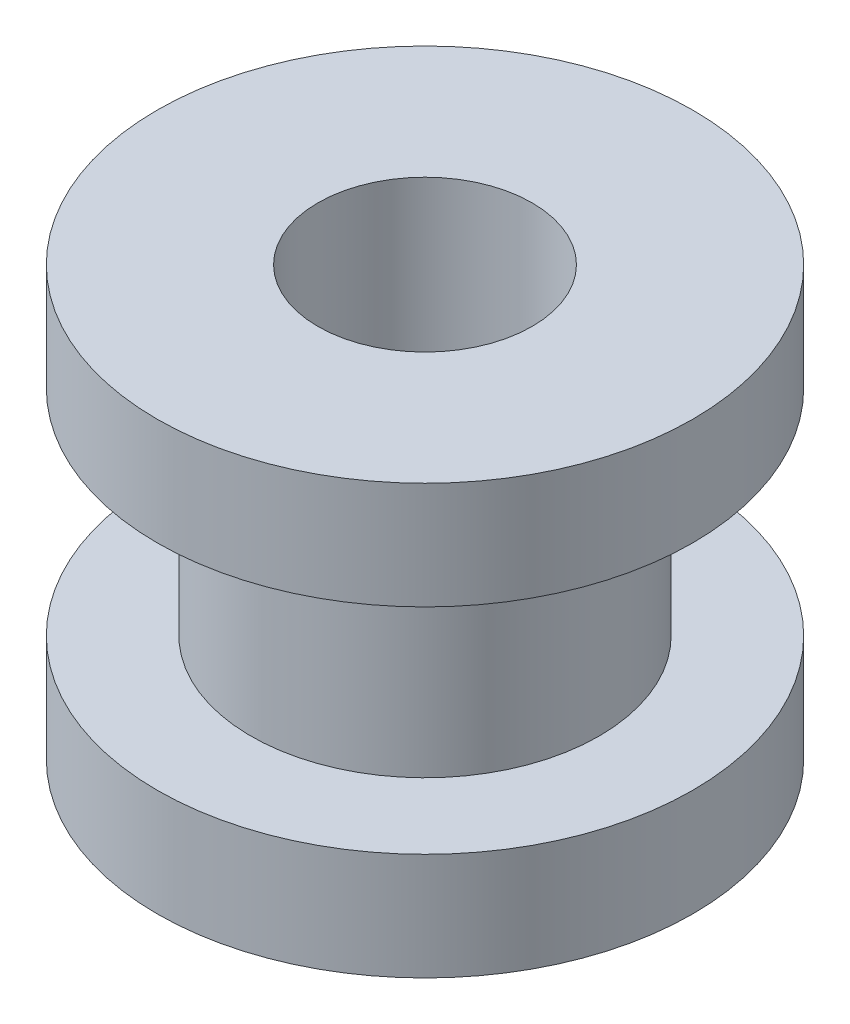
ISO-10303-21;
HEADER;
FILE_DESCRIPTION(('STEP AP214'),'2;1');
FILE_NAME('part.step','',(''),(''),'','','');
FILE_SCHEMA(('AUTOMOTIVE_DESIGN { 1 0 10303 214 1 1 1 1 }'));
ENDSEC;
DATA;
#1=APPLICATION_CONTEXT('core data for automotive mechanical design processes');
#2=APPLICATION_PROTOCOL_DEFINITION('international standard','automotive_design',2000,#1);
#3=PRODUCT_CONTEXT('',#1,'mechanical');
#4=PRODUCT('Part','Part','',(#3));
#5=PRODUCT_RELATED_PRODUCT_CATEGORY('part','',(#4));
#6=PRODUCT_DEFINITION_FORMATION('','',#4);
#7=PRODUCT_DEFINITION_CONTEXT('part definition',#1,'design');
#8=PRODUCT_DEFINITION('design','',#6,#7);
#9=PRODUCT_DEFINITION_SHAPE('','',#8);
#10=(LENGTH_UNIT() NAMED_UNIT(*) SI_UNIT(.MILLI.,.METRE.));
#11=(NAMED_UNIT(*) PLANE_ANGLE_UNIT() SI_UNIT($,.RADIAN.));
#12=(NAMED_UNIT(*) SI_UNIT($,.STERADIAN.) SOLID_ANGLE_UNIT());
#13=UNCERTAINTY_MEASURE_WITH_UNIT(LENGTH_MEASURE(1.E-05),#10,'distance_accuracy_value','');
#14=(GEOMETRIC_REPRESENTATION_CONTEXT(3) GLOBAL_UNCERTAINTY_ASSIGNED_CONTEXT((#13)) GLOBAL_UNIT_ASSIGNED_CONTEXT((#10,
#11,#12)) REPRESENTATION_CONTEXT('',''));
#15=CARTESIAN_POINT('',(0.,0.,0.));
#16=DIRECTION('',(0.,0.,1.));
#17=DIRECTION('',(1.,0.,0.));
#18=AXIS2_PLACEMENT_3D('',#15,#16,#17);
#19=CARTESIAN_POINT('',(5.,4.00000000000001,0.));
#20=DIRECTION('',(0.,1.,0.));
#21=DIRECTION('',(-1.,0.,0.));
#22=AXIS2_PLACEMENT_3D('',#19,#20,#21);
#23=PLANE('',#22);
#24=CARTESIAN_POINT('',(0.,4.,0.));
#25=DIRECTION('',(0.,-1.,0.));
#26=DIRECTION('',(1.,0.,0.));
#27=AXIS2_PLACEMENT_3D('',#24,#25,#26);
#28=CIRCLE('',#27,2.00000000000001);
#29=CARTESIAN_POINT('',(2.,4.00000000000001,0.));
#30=VERTEX_POINT('',#29);
#31=EDGE_CURVE('E10',#30,#30,#28,.T.);
#32=ORIENTED_EDGE('',*,*,#31,.T.);
#33=EDGE_LOOP('',(#32));
#34=FACE_BOUND('',#33,.T.);
#35=CARTESIAN_POINT('',(0.,3.99999999999998,0.));
#36=DIRECTION('',(0.,-1.,0.));
#37=DIRECTION('',(1.,0.,0.));
#38=AXIS2_PLACEMENT_3D('',#35,#36,#37);
#39=CIRCLE('',#38,5.00000000000001);
#40=CARTESIAN_POINT('',(5.,3.99999999999999,0.));
#41=VERTEX_POINT('',#40);
#42=EDGE_CURVE('E64',#41,#41,#39,.T.);
#43=ORIENTED_EDGE('',*,*,#42,.F.);
#44=EDGE_LOOP('',(#43));
#45=FACE_BOUND('',#44,.T.);
#46=ADVANCED_FACE('F36',(#34,#45),#23,.T.);
#47=CARTESIAN_POINT('',(7.25416571160379E-13,-211.476359703337,0.));
#48=DIRECTION('',(0.,-1.,0.));
#49=DIRECTION('',(1.,0.,0.));
#50=AXIS2_PLACEMENT_3D('',#47,#48,#49);
#51=CYLINDRICAL_SURFACE('',#50,2.);
#52=CARTESIAN_POINT('',(0.,-4.,0.));
#53=DIRECTION('',(0.,-1.,0.));
#54=DIRECTION('',(1.,0.,0.));
#55=AXIS2_PLACEMENT_3D('',#52,#53,#54);
#56=CIRCLE('',#55,1.99999999999999);
#57=CARTESIAN_POINT('',(2.,-4.,0.));
#58=VERTEX_POINT('',#57);
#59=EDGE_CURVE('E42',#58,#58,#56,.T.);
#60=ORIENTED_EDGE('',*,*,#59,.T.);
#61=EDGE_LOOP('',(#60));
#62=FACE_BOUND('',#61,.T.);
#63=ORIENTED_EDGE('',*,*,#31,.F.);
#64=EDGE_LOOP('',(#63));
#65=FACE_BOUND('',#64,.T.);
#66=ADVANCED_FACE('F72',(#62,#65),#51,.F.);
#67=CARTESIAN_POINT('',(2.,-4.00000000000001,0.));
#68=DIRECTION('',(0.,-1.,0.));
#69=DIRECTION('',(1.,0.,0.));
#70=AXIS2_PLACEMENT_3D('',#67,#68,#69);
#71=PLANE('',#70);
#72=CARTESIAN_POINT('',(0.,-4.00000000000003,0.));
#73=DIRECTION('',(0.,-1.,0.));
#74=DIRECTION('',(1.,0.,0.));
#75=AXIS2_PLACEMENT_3D('',#72,#73,#74);
#76=CIRCLE('',#75,4.99999999999999);
#77=CARTESIAN_POINT('',(5.,-4.00000000000001,0.));
#78=VERTEX_POINT('',#77);
#79=EDGE_CURVE('E46',#78,#78,#76,.T.);
#80=ORIENTED_EDGE('',*,*,#79,.T.);
#81=EDGE_LOOP('',(#80));
#82=FACE_BOUND('',#81,.T.);
#83=ORIENTED_EDGE('',*,*,#59,.F.);
#84=EDGE_LOOP('',(#83));
#85=FACE_BOUND('',#84,.T.);
#86=ADVANCED_FACE('F76',(#82,#85),#71,.T.);
#87=CARTESIAN_POINT('',(7.25416571160379E-13,-211.476359703337,0.));
#88=DIRECTION('',(0.,-1.,0.));
#89=DIRECTION('',(1.,0.,0.));
#90=AXIS2_PLACEMENT_3D('',#87,#88,#89);
#91=CYLINDRICAL_SURFACE('',#90,4.99999999999999);
#92=CARTESIAN_POINT('',(0.,-2.00000000000003,0.));
#93=DIRECTION('',(0.,-1.,0.));
#94=DIRECTION('',(1.,0.,0.));
#95=AXIS2_PLACEMENT_3D('',#92,#93,#94);
#96=CIRCLE('',#95,4.99999999999999);
#97=CARTESIAN_POINT('',(5.,-2.00000000000001,0.));
#98=VERTEX_POINT('',#97);
#99=EDGE_CURVE('E50',#98,#98,#96,.T.);
#100=ORIENTED_EDGE('',*,*,#99,.T.);
#101=EDGE_LOOP('',(#100));
#102=FACE_BOUND('',#101,.T.);
#103=ORIENTED_EDGE('',*,*,#79,.F.);
#104=EDGE_LOOP('',(#103));
#105=FACE_BOUND('',#104,.T.);
#106=ADVANCED_FACE('F80',(#102,#105),#91,.T.);
#107=CARTESIAN_POINT('',(5.,-2.,0.));
#108=DIRECTION('',(0.,1.,0.));
#109=DIRECTION('',(-1.,0.,0.));
#110=AXIS2_PLACEMENT_3D('',#107,#108,#109);
#111=PLANE('',#110);
#112=CARTESIAN_POINT('',(0.,-2.,0.));
#113=DIRECTION('',(0.,-1.,0.));
#114=DIRECTION('',(1.,0.,0.));
#115=AXIS2_PLACEMENT_3D('',#112,#113,#114);
#116=CIRCLE('',#115,3.24999999999999);
#117=CARTESIAN_POINT('',(3.25,-1.99999999999999,0.));
#118=VERTEX_POINT('',#117);
#119=EDGE_CURVE('E55',#118,#118,#116,.T.);
#120=ORIENTED_EDGE('',*,*,#119,.T.);
#121=EDGE_LOOP('',(#120));
#122=FACE_BOUND('',#121,.T.);
#123=ORIENTED_EDGE('',*,*,#99,.F.);
#124=EDGE_LOOP('',(#123));
#125=FACE_BOUND('',#124,.T.);
#126=ADVANCED_FACE('F87',(#122,#125),#111,.T.);
#127=CARTESIAN_POINT('',(7.25416571160379E-13,-211.476359703337,0.));
#128=DIRECTION('',(0.,-1.,0.));
#129=DIRECTION('',(1.,0.,0.));
#130=AXIS2_PLACEMENT_3D('',#127,#128,#129);
#131=CYLINDRICAL_SURFACE('',#130,3.25);
#132=CARTESIAN_POINT('',(0.,2.,0.));
#133=DIRECTION('',(0.,-1.,0.));
#134=DIRECTION('',(1.,0.,0.));
#135=AXIS2_PLACEMENT_3D('',#132,#133,#134);
#136=CIRCLE('',#135,3.25000000000001);
#137=CARTESIAN_POINT('',(3.25,2.00000000000001,0.));
#138=VERTEX_POINT('',#137);
#139=EDGE_CURVE('E58',#138,#138,#136,.T.);
#140=ORIENTED_EDGE('',*,*,#139,.T.);
#141=EDGE_LOOP('',(#140));
#142=FACE_BOUND('',#141,.T.);
#143=ORIENTED_EDGE('',*,*,#119,.F.);
#144=EDGE_LOOP('',(#143));
#145=FACE_BOUND('',#144,.T.);
#146=ADVANCED_FACE('F91',(#142,#145),#131,.T.);
#147=CARTESIAN_POINT('',(3.25,2.,0.));
#148=DIRECTION('',(0.,-1.,0.));
#149=DIRECTION('',(1.,0.,0.));
#150=AXIS2_PLACEMENT_3D('',#147,#148,#149);
#151=PLANE('',#150);
#152=CARTESIAN_POINT('',(0.,1.99999999999997,0.));
#153=DIRECTION('',(0.,-1.,0.));
#154=DIRECTION('',(1.,0.,0.));
#155=AXIS2_PLACEMENT_3D('',#152,#153,#154);
#156=CIRCLE('',#155,5.00000000000001);
#157=CARTESIAN_POINT('',(5.,1.99999999999999,0.));
#158=VERTEX_POINT('',#157);
#159=EDGE_CURVE('E61',#158,#158,#156,.T.);
#160=ORIENTED_EDGE('',*,*,#159,.T.);
#161=EDGE_LOOP('',(#160));
#162=FACE_BOUND('',#161,.T.);
#163=ORIENTED_EDGE('',*,*,#139,.F.);
#164=EDGE_LOOP('',(#163));
#165=FACE_BOUND('',#164,.T.);
#166=ADVANCED_FACE('F95',(#162,#165),#151,.T.);
#167=CARTESIAN_POINT('',(7.25416571160379E-13,-211.476359703337,0.));
#168=DIRECTION('',(0.,-1.,0.));
#169=DIRECTION('',(1.,0.,0.));
#170=AXIS2_PLACEMENT_3D('',#167,#168,#169);
#171=CYLINDRICAL_SURFACE('',#170,5.00000000000001);
#172=ORIENTED_EDGE('',*,*,#42,.T.);
#173=EDGE_LOOP('',(#172));
#174=FACE_BOUND('',#173,.T.);
#175=ORIENTED_EDGE('',*,*,#159,.F.);
#176=EDGE_LOOP('',(#175));
#177=FACE_BOUND('',#176,.T.);
#178=ADVANCED_FACE('F68',(#174,#177),#171,.T.);
#179=CLOSED_SHELL('',(#46,#66,#86,#106,#126,#146,#166,#178));
#180=MANIFOLD_SOLID_BREP('B2',#179);
#181=ADVANCED_BREP_SHAPE_REPRESENTATION('',(#18,#180),#14);
#182=SHAPE_DEFINITION_REPRESENTATION(#9,#181);
ENDSEC;
END-ISO-10303-21;
